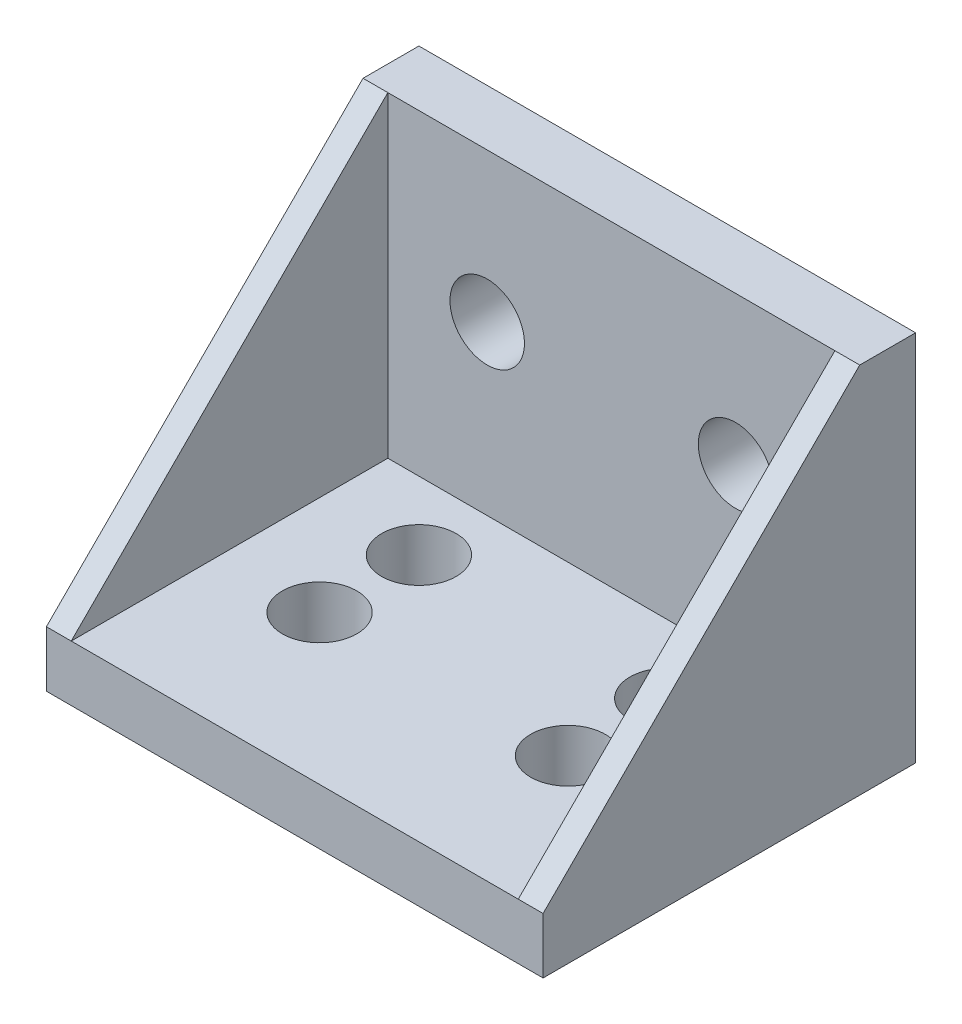
ISO-10303-21;
HEADER;
FILE_DESCRIPTION(('STEP AP214'),'2;1');
FILE_NAME('part.step','',(''),(''),'','','');
FILE_SCHEMA(('AUTOMOTIVE_DESIGN { 1 0 10303 214 1 1 1 1 }'));
ENDSEC;
DATA;
#1=APPLICATION_CONTEXT('core data for automotive mechanical design processes');
#2=APPLICATION_PROTOCOL_DEFINITION('international standard','automotive_design',2000,#1);
#3=PRODUCT_CONTEXT('',#1,'mechanical');
#4=PRODUCT('Part','Part','',(#3));
#5=PRODUCT_RELATED_PRODUCT_CATEGORY('part','',(#4));
#6=PRODUCT_DEFINITION_FORMATION('','',#4);
#7=PRODUCT_DEFINITION_CONTEXT('part definition',#1,'design');
#8=PRODUCT_DEFINITION('design','',#6,#7);
#9=PRODUCT_DEFINITION_SHAPE('','',#8);
#10=(LENGTH_UNIT() NAMED_UNIT(*) SI_UNIT(.MILLI.,.METRE.));
#11=(NAMED_UNIT(*) PLANE_ANGLE_UNIT() SI_UNIT($,.RADIAN.));
#12=(NAMED_UNIT(*) SI_UNIT($,.STERADIAN.) SOLID_ANGLE_UNIT());
#13=UNCERTAINTY_MEASURE_WITH_UNIT(LENGTH_MEASURE(1.E-05),#10,'distance_accuracy_value','');
#14=(GEOMETRIC_REPRESENTATION_CONTEXT(3) GLOBAL_UNCERTAINTY_ASSIGNED_CONTEXT((#13)) GLOBAL_UNIT_ASSIGNED_CONTEXT((#10,
#11,#12)) REPRESENTATION_CONTEXT('',''));
#15=CARTESIAN_POINT('',(0.,0.,0.));
#16=DIRECTION('',(0.,0.,1.));
#17=DIRECTION('',(1.,0.,0.));
#18=AXIS2_PLACEMENT_3D('',#15,#16,#17);
#19=CARTESIAN_POINT('',(20.,30.,4.5));
#20=DIRECTION('',(0.,0.,-1.));
#21=DIRECTION('',(0.,1.,0.));
#22=AXIS2_PLACEMENT_3D('',#19,#20,#21);
#23=PLANE('',#22);
#24=CARTESIAN_POINT('',(-10.,18.,4.5));
#25=DIRECTION('',(0.,0.,1.));
#26=DIRECTION('',(1.,0.,0.));
#27=AXIS2_PLACEMENT_3D('',#24,#25,#26);
#28=CIRCLE('',#27,3.);
#29=CARTESIAN_POINT('',(-7.,18.,4.5));
#30=VERTEX_POINT('',#29);
#31=EDGE_CURVE('E207',#30,#30,#28,.T.);
#32=ORIENTED_EDGE('',*,*,#31,.F.);
#33=EDGE_LOOP('',(#32));
#34=FACE_BOUND('',#33,.T.);
#35=CARTESIAN_POINT('',(10.,18.,4.5));
#36=DIRECTION('',(0.,0.,1.));
#37=DIRECTION('',(1.,0.,0.));
#38=AXIS2_PLACEMENT_3D('',#35,#36,#37);
#39=CIRCLE('',#38,3.);
#40=CARTESIAN_POINT('',(13.,18.,4.5));
#41=VERTEX_POINT('',#40);
#42=EDGE_CURVE('E201',#41,#41,#39,.T.);
#43=ORIENTED_EDGE('',*,*,#42,.F.);
#44=EDGE_LOOP('',(#43));
#45=FACE_BOUND('',#44,.T.);
#46=DIRECTION('',(-1.,0.,0.));
#47=VECTOR('',#46,1.);
#48=CARTESIAN_POINT('',(20.,30.,4.5));
#49=LINE('',#48,#47);
#50=CARTESIAN_POINT('',(18.,30.,4.5));
#51=VERTEX_POINT('',#50);
#52=CARTESIAN_POINT('',(-18.,30.,4.5));
#53=VERTEX_POINT('',#52);
#54=EDGE_CURVE('E106',#51,#53,#49,.T.);
#55=ORIENTED_EDGE('',*,*,#54,.T.);
#56=DIRECTION('',(0.,-1.,0.));
#57=VECTOR('',#56,1.);
#58=CARTESIAN_POINT('',(-18.,30.,4.5));
#59=LINE('',#58,#57);
#60=CARTESIAN_POINT('',(-18.,4.5,4.5));
#61=VERTEX_POINT('',#60);
#62=EDGE_CURVE('E47',#53,#61,#59,.T.);
#63=ORIENTED_EDGE('',*,*,#62,.T.);
#64=DIRECTION('',(-1.,0.,0.));
#65=VECTOR('',#64,1.);
#66=CARTESIAN_POINT('',(20.,4.5,4.5));
#67=LINE('',#66,#65);
#68=CARTESIAN_POINT('',(18.,4.5,4.5));
#69=VERTEX_POINT('',#68);
#70=EDGE_CURVE('E117',#69,#61,#67,.T.);
#71=ORIENTED_EDGE('',*,*,#70,.F.);
#72=DIRECTION('',(0.,-1.,0.));
#73=VECTOR('',#72,1.);
#74=CARTESIAN_POINT('',(18.,30.,4.5));
#75=LINE('',#74,#73);
#76=EDGE_CURVE('E111',#51,#69,#75,.T.);
#77=ORIENTED_EDGE('',*,*,#76,.F.);
#78=EDGE_LOOP('',(#55,#63,#71,#77));
#79=FACE_BOUND('',#78,.T.);
#80=ADVANCED_FACE('F32',(#34,#45,#79),#23,.F.);
#81=CARTESIAN_POINT('',(20.,4.5,4.5));
#82=DIRECTION('',(0.,-1.,0.));
#83=DIRECTION('',(0.,0.,-1.));
#84=AXIS2_PLACEMENT_3D('',#81,#82,#83);
#85=PLANE('',#84);
#86=CARTESIAN_POINT('',(-10.,4.5,10.));
#87=DIRECTION('',(0.,1.,0.));
#88=DIRECTION('',(0.,0.,1.));
#89=AXIS2_PLACEMENT_3D('',#86,#87,#88);
#90=CIRCLE('',#89,3.);
#91=CARTESIAN_POINT('',(-10.,4.5,13.));
#92=VERTEX_POINT('',#91);
#93=EDGE_CURVE('E195',#92,#92,#90,.T.);
#94=ORIENTED_EDGE('',*,*,#93,.F.);
#95=EDGE_LOOP('',(#94));
#96=FACE_BOUND('',#95,.T.);
#97=CARTESIAN_POINT('',(-10.,4.5,18.));
#98=DIRECTION('',(0.,1.,0.));
#99=DIRECTION('',(0.,0.,1.));
#100=AXIS2_PLACEMENT_3D('',#97,#98,#99);
#101=CIRCLE('',#100,3.);
#102=CARTESIAN_POINT('',(-10.,4.5,21.));
#103=VERTEX_POINT('',#102);
#104=EDGE_CURVE('E189',#103,#103,#101,.T.);
#105=ORIENTED_EDGE('',*,*,#104,.F.);
#106=EDGE_LOOP('',(#105));
#107=FACE_BOUND('',#106,.T.);
#108=CARTESIAN_POINT('',(10.,4.5,10.));
#109=DIRECTION('',(0.,1.,0.));
#110=DIRECTION('',(0.,0.,1.));
#111=AXIS2_PLACEMENT_3D('',#108,#109,#110);
#112=CIRCLE('',#111,3.);
#113=CARTESIAN_POINT('',(10.,4.5,13.));
#114=VERTEX_POINT('',#113);
#115=EDGE_CURVE('E183',#114,#114,#112,.T.);
#116=ORIENTED_EDGE('',*,*,#115,.F.);
#117=EDGE_LOOP('',(#116));
#118=FACE_BOUND('',#117,.T.);
#119=CARTESIAN_POINT('',(10.,4.5,18.));
#120=DIRECTION('',(0.,1.,0.));
#121=DIRECTION('',(0.,0.,1.));
#122=AXIS2_PLACEMENT_3D('',#119,#120,#121);
#123=CIRCLE('',#122,3.);
#124=CARTESIAN_POINT('',(10.,4.5,21.));
#125=VERTEX_POINT('',#124);
#126=EDGE_CURVE('E118',#125,#125,#123,.T.);
#127=ORIENTED_EDGE('',*,*,#126,.F.);
#128=EDGE_LOOP('',(#127));
#129=FACE_BOUND('',#128,.T.);
#130=ORIENTED_EDGE('',*,*,#70,.T.);
#131=DIRECTION('',(0.,0.,1.));
#132=VECTOR('',#131,1.);
#133=CARTESIAN_POINT('',(-18.,4.5,4.5));
#134=LINE('',#133,#132);
#135=CARTESIAN_POINT('',(-18.,4.5,30.));
#136=VERTEX_POINT('',#135);
#137=EDGE_CURVE('E171',#61,#136,#134,.T.);
#138=ORIENTED_EDGE('',*,*,#137,.T.);
#139=DIRECTION('',(-1.,0.,0.));
#140=VECTOR('',#139,1.);
#141=CARTESIAN_POINT('',(20.,4.5,30.));
#142=LINE('',#141,#140);
#143=CARTESIAN_POINT('',(18.,4.5,30.));
#144=VERTEX_POINT('',#143);
#145=EDGE_CURVE('E153',#144,#136,#142,.T.);
#146=ORIENTED_EDGE('',*,*,#145,.F.);
#147=DIRECTION('',(0.,0.,1.));
#148=VECTOR('',#147,1.);
#149=CARTESIAN_POINT('',(18.,4.5,4.5));
#150=LINE('',#149,#148);
#151=EDGE_CURVE('E113',#69,#144,#150,.T.);
#152=ORIENTED_EDGE('',*,*,#151,.F.);
#153=EDGE_LOOP('',(#130,#138,#146,#152));
#154=FACE_BOUND('',#153,.T.);
#155=ADVANCED_FACE('F237',(#96,#107,#118,#129,#154),#85,.F.);
#156=CARTESIAN_POINT('',(20.,0.,30.));
#157=DIRECTION('',(0.,1.,0.));
#158=DIRECTION('',(0.,0.,1.));
#159=AXIS2_PLACEMENT_3D('',#156,#157,#158);
#160=PLANE('',#159);
#161=DIRECTION('',(-1.,0.,0.));
#162=VECTOR('',#161,1.);
#163=CARTESIAN_POINT('',(20.,0.,30.));
#164=LINE('',#163,#162);
#165=CARTESIAN_POINT('',(20.,0.,30.));
#166=VERTEX_POINT('',#165);
#167=CARTESIAN_POINT('',(-20.,0.,30.));
#168=VERTEX_POINT('',#167);
#169=EDGE_CURVE('E152',#166,#168,#164,.T.);
#170=ORIENTED_EDGE('',*,*,#169,.T.);
#171=DIRECTION('',(0.,0.,-1.));
#172=VECTOR('',#171,1.);
#173=CARTESIAN_POINT('',(-20.,0.,30.));
#174=LINE('',#173,#172);
#175=CARTESIAN_POINT('',(-20.,0.,0.));
#176=VERTEX_POINT('',#175);
#177=EDGE_CURVE('E138',#168,#176,#174,.T.);
#178=ORIENTED_EDGE('',*,*,#177,.T.);
#179=DIRECTION('',(-1.,0.,0.));
#180=VECTOR('',#179,1.);
#181=CARTESIAN_POINT('',(20.,0.,0.));
#182=LINE('',#181,#180);
#183=CARTESIAN_POINT('',(20.,0.,0.));
#184=VERTEX_POINT('',#183);
#185=EDGE_CURVE('E11',#184,#176,#182,.T.);
#186=ORIENTED_EDGE('',*,*,#185,.F.);
#187=DIRECTION('',(0.,0.,-1.));
#188=VECTOR('',#187,1.);
#189=CARTESIAN_POINT('',(20.,0.,30.));
#190=LINE('',#189,#188);
#191=EDGE_CURVE('E148',#166,#184,#190,.T.);
#192=ORIENTED_EDGE('',*,*,#191,.F.);
#193=EDGE_LOOP('',(#170,#178,#186,#192));
#194=FACE_BOUND('',#193,.T.);
#195=CARTESIAN_POINT('',(-10.,0.,10.));
#196=DIRECTION('',(0.,1.,0.));
#197=DIRECTION('',(0.,0.,1.));
#198=AXIS2_PLACEMENT_3D('',#195,#196,#197);
#199=CIRCLE('',#198,3.);
#200=CARTESIAN_POINT('',(-10.,0.,13.));
#201=VERTEX_POINT('',#200);
#202=EDGE_CURVE('E198',#201,#201,#199,.T.);
#203=ORIENTED_EDGE('',*,*,#202,.T.);
#204=EDGE_LOOP('',(#203));
#205=FACE_BOUND('',#204,.T.);
#206=CARTESIAN_POINT('',(-10.,0.,18.));
#207=DIRECTION('',(0.,1.,0.));
#208=DIRECTION('',(0.,0.,1.));
#209=AXIS2_PLACEMENT_3D('',#206,#207,#208);
#210=CIRCLE('',#209,3.);
#211=CARTESIAN_POINT('',(-10.,0.,21.));
#212=VERTEX_POINT('',#211);
#213=EDGE_CURVE('E192',#212,#212,#210,.T.);
#214=ORIENTED_EDGE('',*,*,#213,.T.);
#215=EDGE_LOOP('',(#214));
#216=FACE_BOUND('',#215,.T.);
#217=CARTESIAN_POINT('',(10.,0.,10.));
#218=DIRECTION('',(0.,1.,0.));
#219=DIRECTION('',(0.,0.,1.));
#220=AXIS2_PLACEMENT_3D('',#217,#218,#219);
#221=CIRCLE('',#220,3.);
#222=CARTESIAN_POINT('',(10.,0.,13.));
#223=VERTEX_POINT('',#222);
#224=EDGE_CURVE('E186',#223,#223,#221,.T.);
#225=ORIENTED_EDGE('',*,*,#224,.T.);
#226=EDGE_LOOP('',(#225));
#227=FACE_BOUND('',#226,.T.);
#228=CARTESIAN_POINT('',(10.,0.,18.));
#229=DIRECTION('',(0.,1.,0.));
#230=DIRECTION('',(0.,0.,1.));
#231=AXIS2_PLACEMENT_3D('',#228,#229,#230);
#232=CIRCLE('',#231,3.);
#233=CARTESIAN_POINT('',(10.,0.,21.));
#234=VERTEX_POINT('',#233);
#235=EDGE_CURVE('E180',#234,#234,#232,.T.);
#236=ORIENTED_EDGE('',*,*,#235,.T.);
#237=EDGE_LOOP('',(#236));
#238=FACE_BOUND('',#237,.T.);
#239=ADVANCED_FACE('F34',(#194,#205,#216,#227,#238),#160,.F.);
#240=CARTESIAN_POINT('',(20.,0.,0.));
#241=DIRECTION('',(0.,0.,1.));
#242=DIRECTION('',(1.,0.,0.));
#243=AXIS2_PLACEMENT_3D('',#240,#241,#242);
#244=PLANE('',#243);
#245=ORIENTED_EDGE('',*,*,#185,.T.);
#246=DIRECTION('',(0.,1.,0.));
#247=VECTOR('',#246,1.);
#248=CARTESIAN_POINT('',(-20.,0.,0.));
#249=LINE('',#248,#247);
#250=CARTESIAN_POINT('',(-20.,30.,0.));
#251=VERTEX_POINT('',#250);
#252=EDGE_CURVE('E131',#176,#251,#249,.T.);
#253=ORIENTED_EDGE('',*,*,#252,.T.);
#254=DIRECTION('',(-1.,0.,0.));
#255=VECTOR('',#254,1.);
#256=CARTESIAN_POINT('',(20.,30.,0.));
#257=LINE('',#256,#255);
#258=CARTESIAN_POINT('',(20.,30.,0.));
#259=VERTEX_POINT('',#258);
#260=EDGE_CURVE('E40',#259,#251,#257,.T.);
#261=ORIENTED_EDGE('',*,*,#260,.F.);
#262=DIRECTION('',(0.,1.,0.));
#263=VECTOR('',#262,1.);
#264=CARTESIAN_POINT('',(20.,0.,0.));
#265=LINE('',#264,#263);
#266=EDGE_CURVE('E217',#184,#259,#265,.T.);
#267=ORIENTED_EDGE('',*,*,#266,.F.);
#268=EDGE_LOOP('',(#245,#253,#261,#267));
#269=FACE_BOUND('',#268,.T.);
#270=CARTESIAN_POINT('',(-10.,18.,0.));
#271=DIRECTION('',(0.,0.,1.));
#272=DIRECTION('',(1.,0.,0.));
#273=AXIS2_PLACEMENT_3D('',#270,#271,#272);
#274=CIRCLE('',#273,3.);
#275=CARTESIAN_POINT('',(-7.,18.,0.));
#276=VERTEX_POINT('',#275);
#277=EDGE_CURVE('E210',#276,#276,#274,.T.);
#278=ORIENTED_EDGE('',*,*,#277,.T.);
#279=EDGE_LOOP('',(#278));
#280=FACE_BOUND('',#279,.T.);
#281=CARTESIAN_POINT('',(10.,18.,0.));
#282=DIRECTION('',(0.,0.,1.));
#283=DIRECTION('',(1.,0.,0.));
#284=AXIS2_PLACEMENT_3D('',#281,#282,#283);
#285=CIRCLE('',#284,3.);
#286=CARTESIAN_POINT('',(13.,18.,0.));
#287=VERTEX_POINT('',#286);
#288=EDGE_CURVE('E204',#287,#287,#285,.T.);
#289=ORIENTED_EDGE('',*,*,#288,.T.);
#290=EDGE_LOOP('',(#289));
#291=FACE_BOUND('',#290,.T.);
#292=ADVANCED_FACE('F132',(#269,#280,#291),#244,.F.);
#293=CARTESIAN_POINT('',(20.,30.,0.));
#294=DIRECTION('',(0.,-1.,0.));
#295=DIRECTION('',(0.,0.,-1.));
#296=AXIS2_PLACEMENT_3D('',#293,#294,#295);
#297=PLANE('',#296);
#298=ORIENTED_EDGE('',*,*,#260,.T.);
#299=DIRECTION('',(0.,0.,1.));
#300=VECTOR('',#299,1.);
#301=CARTESIAN_POINT('',(-20.,30.,0.));
#302=LINE('',#301,#300);
#303=CARTESIAN_POINT('',(-20.,30.,4.5));
#304=VERTEX_POINT('',#303);
#305=EDGE_CURVE('E127',#251,#304,#302,.T.);
#306=ORIENTED_EDGE('',*,*,#305,.T.);
#307=DIRECTION('',(-1.,0.,0.));
#308=VECTOR('',#307,1.);
#309=CARTESIAN_POINT('',(-18.,30.,4.5));
#310=LINE('',#309,#308);
#311=EDGE_CURVE('E55',#53,#304,#310,.T.);
#312=ORIENTED_EDGE('',*,*,#311,.F.);
#313=ORIENTED_EDGE('',*,*,#54,.F.);
#314=CARTESIAN_POINT('',(20.,30.,4.5));
#315=VERTEX_POINT('',#314);
#316=EDGE_CURVE('E97',#315,#51,#49,.T.);
#317=ORIENTED_EDGE('',*,*,#316,.F.);
#318=DIRECTION('',(0.,0.,1.));
#319=VECTOR('',#318,1.);
#320=CARTESIAN_POINT('',(20.,30.,0.));
#321=LINE('',#320,#319);
#322=EDGE_CURVE('E128',#259,#315,#321,.T.);
#323=ORIENTED_EDGE('',*,*,#322,.F.);
#324=EDGE_LOOP('',(#298,#306,#312,#313,#317,#323));
#325=FACE_BOUND('',#324,.T.);
#326=ADVANCED_FACE('F120',(#325),#297,.F.);
#327=CARTESIAN_POINT('',(20.,4.5,30.));
#328=DIRECTION('',(0.,0.,-1.));
#329=DIRECTION('',(-1.,0.,0.));
#330=AXIS2_PLACEMENT_3D('',#327,#328,#329);
#331=PLANE('',#330);
#332=CARTESIAN_POINT('',(20.,4.5,30.));
#333=VERTEX_POINT('',#332);
#334=EDGE_CURVE('E121',#333,#144,#142,.T.);
#335=ORIENTED_EDGE('',*,*,#334,.T.);
#336=ORIENTED_EDGE('',*,*,#145,.T.);
#337=DIRECTION('',(-1.,0.,0.));
#338=VECTOR('',#337,1.);
#339=CARTESIAN_POINT('',(-18.,4.5,30.));
#340=LINE('',#339,#338);
#341=CARTESIAN_POINT('',(-20.,4.5,30.));
#342=VERTEX_POINT('',#341);
#343=EDGE_CURVE('E161',#136,#342,#340,.T.);
#344=ORIENTED_EDGE('',*,*,#343,.T.);
#345=DIRECTION('',(0.,-1.,0.));
#346=VECTOR('',#345,1.);
#347=CARTESIAN_POINT('',(-20.,4.5,30.));
#348=LINE('',#347,#346);
#349=EDGE_CURVE('E145',#342,#168,#348,.T.);
#350=ORIENTED_EDGE('',*,*,#349,.T.);
#351=ORIENTED_EDGE('',*,*,#169,.F.);
#352=DIRECTION('',(0.,-1.,0.));
#353=VECTOR('',#352,1.);
#354=CARTESIAN_POINT('',(20.,4.5,30.));
#355=LINE('',#354,#353);
#356=EDGE_CURVE('E154',#333,#166,#355,.T.);
#357=ORIENTED_EDGE('',*,*,#356,.F.);
#358=EDGE_LOOP('',(#335,#336,#344,#350,#351,#357));
#359=FACE_BOUND('',#358,.T.);
#360=ADVANCED_FACE('F160',(#359),#331,.F.);
#361=CARTESIAN_POINT('',(20.,0.,0.));
#362=DIRECTION('',(1.,0.,0.));
#363=DIRECTION('',(0.,0.,-1.));
#364=AXIS2_PLACEMENT_3D('',#361,#362,#363);
#365=PLANE('',#364);
#366=ORIENTED_EDGE('',*,*,#191,.T.);
#367=ORIENTED_EDGE('',*,*,#266,.T.);
#368=ORIENTED_EDGE('',*,*,#322,.T.);
#369=DIRECTION('',(0.,-0.707106781186548,0.707106781186548));
#370=VECTOR('',#369,1.);
#371=CARTESIAN_POINT('',(20.,30.,4.5));
#372=LINE('',#371,#370);
#373=EDGE_CURVE('E103',#315,#333,#372,.T.);
#374=ORIENTED_EDGE('',*,*,#373,.T.);
#375=ORIENTED_EDGE('',*,*,#356,.T.);
#376=EDGE_LOOP('',(#366,#367,#368,#374,#375));
#377=FACE_BOUND('',#376,.T.);
#378=ADVANCED_FACE('F225',(#377),#365,.T.);
#379=CARTESIAN_POINT('',(-20.,0.,0.));
#380=DIRECTION('',(1.,0.,0.));
#381=DIRECTION('',(0.,0.,-1.));
#382=AXIS2_PLACEMENT_3D('',#379,#380,#381);
#383=PLANE('',#382);
#384=ORIENTED_EDGE('',*,*,#349,.F.);
#385=DIRECTION('',(0.,0.707106781186548,-0.707106781186548));
#386=VECTOR('',#385,1.);
#387=CARTESIAN_POINT('',(-20.,4.5,30.));
#388=LINE('',#387,#386);
#389=EDGE_CURVE('E144',#342,#304,#388,.T.);
#390=ORIENTED_EDGE('',*,*,#389,.T.);
#391=ORIENTED_EDGE('',*,*,#305,.F.);
#392=ORIENTED_EDGE('',*,*,#252,.F.);
#393=ORIENTED_EDGE('',*,*,#177,.F.);
#394=EDGE_LOOP('',(#384,#390,#391,#392,#393));
#395=FACE_BOUND('',#394,.T.);
#396=ADVANCED_FACE('F142',(#395),#383,.F.);
#397=CARTESIAN_POINT('',(-10.,18.,0.));
#398=DIRECTION('',(0.,0.,1.));
#399=DIRECTION('',(1.,0.,0.));
#400=AXIS2_PLACEMENT_3D('',#397,#398,#399);
#401=CYLINDRICAL_SURFACE('',#400,3.);
#402=ORIENTED_EDGE('',*,*,#277,.F.);
#403=EDGE_LOOP('',(#402));
#404=FACE_BOUND('',#403,.T.);
#405=ORIENTED_EDGE('',*,*,#31,.T.);
#406=EDGE_LOOP('',(#405));
#407=FACE_BOUND('',#406,.T.);
#408=ADVANCED_FACE('F232',(#404,#407),#401,.F.);
#409=CARTESIAN_POINT('',(10.,18.,0.));
#410=DIRECTION('',(0.,0.,1.));
#411=DIRECTION('',(1.,0.,0.));
#412=AXIS2_PLACEMENT_3D('',#409,#410,#411);
#413=CYLINDRICAL_SURFACE('',#412,3.);
#414=ORIENTED_EDGE('',*,*,#288,.F.);
#415=EDGE_LOOP('',(#414));
#416=FACE_BOUND('',#415,.T.);
#417=ORIENTED_EDGE('',*,*,#42,.T.);
#418=EDGE_LOOP('',(#417));
#419=FACE_BOUND('',#418,.T.);
#420=ADVANCED_FACE('F327',(#416,#419),#413,.F.);
#421=CARTESIAN_POINT('',(-10.,0.,10.));
#422=DIRECTION('',(0.,1.,0.));
#423=DIRECTION('',(0.,0.,1.));
#424=AXIS2_PLACEMENT_3D('',#421,#422,#423);
#425=CYLINDRICAL_SURFACE('',#424,3.);
#426=ORIENTED_EDGE('',*,*,#202,.F.);
#427=EDGE_LOOP('',(#426));
#428=FACE_BOUND('',#427,.T.);
#429=ORIENTED_EDGE('',*,*,#93,.T.);
#430=EDGE_LOOP('',(#429));
#431=FACE_BOUND('',#430,.T.);
#432=ADVANCED_FACE('F323',(#428,#431),#425,.F.);
#433=CARTESIAN_POINT('',(-10.,0.,18.));
#434=DIRECTION('',(0.,1.,0.));
#435=DIRECTION('',(0.,0.,1.));
#436=AXIS2_PLACEMENT_3D('',#433,#434,#435);
#437=CYLINDRICAL_SURFACE('',#436,3.);
#438=ORIENTED_EDGE('',*,*,#213,.F.);
#439=EDGE_LOOP('',(#438));
#440=FACE_BOUND('',#439,.T.);
#441=ORIENTED_EDGE('',*,*,#104,.T.);
#442=EDGE_LOOP('',(#441));
#443=FACE_BOUND('',#442,.T.);
#444=ADVANCED_FACE('F319',(#440,#443),#437,.F.);
#445=CARTESIAN_POINT('',(10.,0.,10.));
#446=DIRECTION('',(0.,1.,0.));
#447=DIRECTION('',(0.,0.,1.));
#448=AXIS2_PLACEMENT_3D('',#445,#446,#447);
#449=CYLINDRICAL_SURFACE('',#448,3.);
#450=ORIENTED_EDGE('',*,*,#224,.F.);
#451=EDGE_LOOP('',(#450));
#452=FACE_BOUND('',#451,.T.);
#453=ORIENTED_EDGE('',*,*,#115,.T.);
#454=EDGE_LOOP('',(#453));
#455=FACE_BOUND('',#454,.T.);
#456=ADVANCED_FACE('F315',(#452,#455),#449,.F.);
#457=CARTESIAN_POINT('',(10.,0.,18.));
#458=DIRECTION('',(0.,1.,0.));
#459=DIRECTION('',(0.,0.,1.));
#460=AXIS2_PLACEMENT_3D('',#457,#458,#459);
#461=CYLINDRICAL_SURFACE('',#460,3.);
#462=ORIENTED_EDGE('',*,*,#235,.F.);
#463=EDGE_LOOP('',(#462));
#464=FACE_BOUND('',#463,.T.);
#465=ORIENTED_EDGE('',*,*,#126,.T.);
#466=EDGE_LOOP('',(#465));
#467=FACE_BOUND('',#466,.T.);
#468=ADVANCED_FACE('F311',(#464,#467),#461,.F.);
#469=CARTESIAN_POINT('',(18.,0.,0.));
#470=DIRECTION('',(1.,0.,0.));
#471=DIRECTION('',(0.,0.,-1.));
#472=AXIS2_PLACEMENT_3D('',#469,#470,#471);
#473=PLANE('',#472);
#474=DIRECTION('',(0.,-0.707106781186548,0.707106781186548));
#475=VECTOR('',#474,1.);
#476=CARTESIAN_POINT('',(18.,30.,4.5));
#477=LINE('',#476,#475);
#478=EDGE_CURVE('E100',#51,#144,#477,.T.);
#479=ORIENTED_EDGE('',*,*,#478,.F.);
#480=ORIENTED_EDGE('',*,*,#76,.T.);
#481=ORIENTED_EDGE('',*,*,#151,.T.);
#482=EDGE_LOOP('',(#479,#480,#481));
#483=FACE_BOUND('',#482,.T.);
#484=ADVANCED_FACE('F110',(#483),#473,.F.);
#485=CARTESIAN_POINT('',(18.,30.,4.5));
#486=DIRECTION('',(0.,0.707106781186547,0.707106781186547));
#487=DIRECTION('',(0.,-0.707106781186548,0.707106781186548));
#488=AXIS2_PLACEMENT_3D('',#485,#486,#487);
#489=PLANE('',#488);
#490=ORIENTED_EDGE('',*,*,#373,.F.);
#491=ORIENTED_EDGE('',*,*,#316,.T.);
#492=ORIENTED_EDGE('',*,*,#478,.T.);
#493=ORIENTED_EDGE('',*,*,#334,.F.);
#494=EDGE_LOOP('',(#490,#491,#492,#493));
#495=FACE_BOUND('',#494,.T.);
#496=ADVANCED_FACE('F99',(#495),#489,.T.);
#497=CARTESIAN_POINT('',(-18.,4.5,30.));
#498=DIRECTION('',(0.,0.707106781186547,0.707106781186547));
#499=DIRECTION('',(0.,-0.707106781186548,0.707106781186548));
#500=AXIS2_PLACEMENT_3D('',#497,#498,#499);
#501=PLANE('',#500);
#502=ORIENTED_EDGE('',*,*,#389,.F.);
#503=ORIENTED_EDGE('',*,*,#343,.F.);
#504=DIRECTION('',(0.,0.707106781186548,-0.707106781186548));
#505=VECTOR('',#504,1.);
#506=CARTESIAN_POINT('',(-18.,4.5,30.));
#507=LINE('',#506,#505);
#508=EDGE_CURVE('E166',#136,#53,#507,.T.);
#509=ORIENTED_EDGE('',*,*,#508,.T.);
#510=ORIENTED_EDGE('',*,*,#311,.T.);
#511=EDGE_LOOP('',(#502,#503,#509,#510));
#512=FACE_BOUND('',#511,.T.);
#513=ADVANCED_FACE('F165',(#512),#501,.T.);
#514=CARTESIAN_POINT('',(-18.,0.,0.));
#515=DIRECTION('',(1.,0.,0.));
#516=DIRECTION('',(0.,0.,-1.));
#517=AXIS2_PLACEMENT_3D('',#514,#515,#516);
#518=PLANE('',#517);
#519=ORIENTED_EDGE('',*,*,#137,.F.);
#520=ORIENTED_EDGE('',*,*,#62,.F.);
#521=ORIENTED_EDGE('',*,*,#508,.F.);
#522=EDGE_LOOP('',(#519,#520,#521));
#523=FACE_BOUND('',#522,.T.);
#524=ADVANCED_FACE('F170',(#523),#518,.T.);
#525=CLOSED_SHELL('',(#80,#155,#239,#292,#326,#360,#378,#396,#408,#420,#432,#444,#456,#468,#484,
#496,#513,#524));
#526=MANIFOLD_SOLID_BREP('B2',#525);
#527=ADVANCED_BREP_SHAPE_REPRESENTATION('',(#18,#526),#14);
#528=SHAPE_DEFINITION_REPRESENTATION(#9,#527);
ENDSEC;
END-ISO-10303-21;
